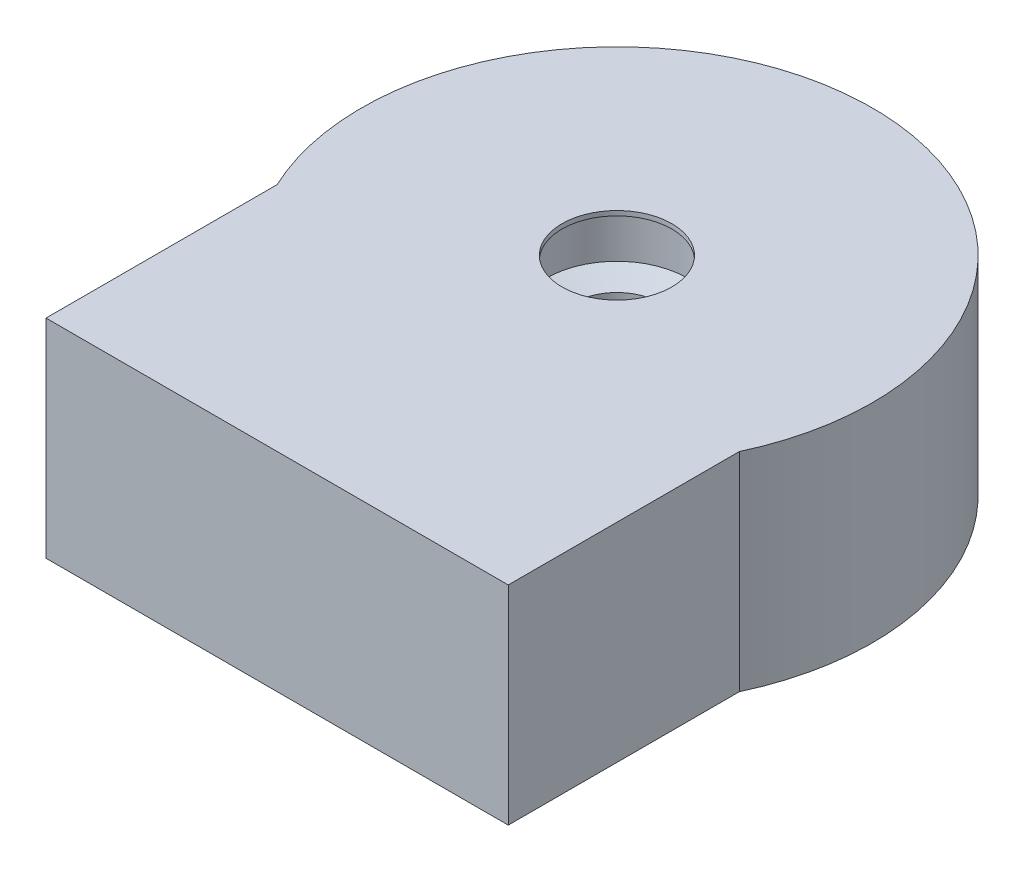
ISO-10303-21;
HEADER;
FILE_DESCRIPTION(('STEP AP214'),'2;1');
FILE_NAME('part.step','',(''),(''),'','','');
FILE_SCHEMA(('AUTOMOTIVE_DESIGN { 1 0 10303 214 1 1 1 1 }'));
ENDSEC;
DATA;
#1=APPLICATION_CONTEXT('core data for automotive mechanical design processes');
#2=APPLICATION_PROTOCOL_DEFINITION('international standard','automotive_design',2000,#1);
#3=PRODUCT_CONTEXT('',#1,'mechanical');
#4=PRODUCT('Part','Part','',(#3));
#5=PRODUCT_RELATED_PRODUCT_CATEGORY('part','',(#4));
#6=PRODUCT_DEFINITION_FORMATION('','',#4);
#7=PRODUCT_DEFINITION_CONTEXT('part definition',#1,'design');
#8=PRODUCT_DEFINITION('design','',#6,#7);
#9=PRODUCT_DEFINITION_SHAPE('','',#8);
#10=(LENGTH_UNIT() NAMED_UNIT(*) SI_UNIT(.MILLI.,.METRE.));
#11=(NAMED_UNIT(*) PLANE_ANGLE_UNIT() SI_UNIT($,.RADIAN.));
#12=(NAMED_UNIT(*) SI_UNIT($,.STERADIAN.) SOLID_ANGLE_UNIT());
#13=UNCERTAINTY_MEASURE_WITH_UNIT(LENGTH_MEASURE(1.E-05),#10,'distance_accuracy_value','');
#14=(GEOMETRIC_REPRESENTATION_CONTEXT(3) GLOBAL_UNCERTAINTY_ASSIGNED_CONTEXT((#13)) GLOBAL_UNIT_ASSIGNED_CONTEXT((#10,
#11,#12)) REPRESENTATION_CONTEXT('',''));
#15=CARTESIAN_POINT('',(0.,0.,0.));
#16=DIRECTION('',(0.,0.,1.));
#17=DIRECTION('',(1.,0.,0.));
#18=AXIS2_PLACEMENT_3D('',#15,#16,#17);
#19=CARTESIAN_POINT('',(0.,0.,0.));
#20=DIRECTION('',(0.,-1.,0.));
#21=DIRECTION('',(0.,0.,-1.));
#22=AXIS2_PLACEMENT_3D('',#19,#20,#21);
#23=CYLINDRICAL_SURFACE('',#22,11.05);
#24=DIRECTION('',(0.,1.,0.));
#25=VECTOR('',#24,1.);
#26=CARTESIAN_POINT('',(10.,-31.3606797749979,4.70132959916661));
#27=LINE('',#26,#25);
#28=CARTESIAN_POINT('',(10.,-9.,4.70132959916661));
#29=VERTEX_POINT('',#28);
#30=CARTESIAN_POINT('',(10.,0.,4.70132959916661));
#31=VERTEX_POINT('',#30);
#32=EDGE_CURVE('E77',#29,#31,#27,.T.);
#33=ORIENTED_EDGE('',*,*,#32,.F.);
#34=CARTESIAN_POINT('',(0.,-9.,0.));
#35=DIRECTION('',(0.,-1.,0.));
#36=DIRECTION('',(0.,0.,-1.));
#37=AXIS2_PLACEMENT_3D('',#34,#35,#36);
#38=CIRCLE('',#37,11.05);
#39=CARTESIAN_POINT('',(-10.,-9.,4.7013295991666));
#40=VERTEX_POINT('',#39);
#41=EDGE_CURVE('E97',#40,#29,#38,.T.);
#42=ORIENTED_EDGE('',*,*,#41,.F.);
#43=DIRECTION('',(0.,1.,0.));
#44=VECTOR('',#43,1.);
#45=CARTESIAN_POINT('',(-10.,-31.3606797749979,4.70132959916661));
#46=LINE('',#45,#44);
#47=CARTESIAN_POINT('',(-10.,0.,4.70132959916661));
#48=VERTEX_POINT('',#47);
#49=EDGE_CURVE('E98',#40,#48,#46,.T.);
#50=ORIENTED_EDGE('',*,*,#49,.T.);
#51=CARTESIAN_POINT('',(0.,0.,0.));
#52=DIRECTION('',(0.,-1.,0.));
#53=DIRECTION('',(0.,0.,-1.));
#54=AXIS2_PLACEMENT_3D('',#51,#52,#53);
#55=CIRCLE('',#54,11.05);
#56=EDGE_CURVE('E11',#48,#31,#55,.T.);
#57=ORIENTED_EDGE('',*,*,#56,.T.);
#58=EDGE_LOOP('',(#33,#42,#50,#57));
#59=FACE_BOUND('',#58,.T.);
#60=ADVANCED_FACE('F39',(#59),#23,.T.);
#61=CARTESIAN_POINT('',(11.05,0.,0.));
#62=DIRECTION('',(0.,1.,0.));
#63=DIRECTION('',(0.,0.,1.));
#64=AXIS2_PLACEMENT_3D('',#61,#62,#63);
#65=PLANE('',#64);
#66=ORIENTED_EDGE('',*,*,#56,.F.);
#67=DIRECTION('',(0.,0.,-1.));
#68=VECTOR('',#67,1.);
#69=CARTESIAN_POINT('',(-10.,0.,14.7013295991666));
#70=LINE('',#69,#68);
#71=CARTESIAN_POINT('',(-10.,0.,14.7013295991666));
#72=VERTEX_POINT('',#71);
#73=EDGE_CURVE('E106',#72,#48,#70,.T.);
#74=ORIENTED_EDGE('',*,*,#73,.F.);
#75=DIRECTION('',(1.,0.,0.));
#76=VECTOR('',#75,1.);
#77=CARTESIAN_POINT('',(-10.,0.,14.7013295991666));
#78=LINE('',#77,#76);
#79=CARTESIAN_POINT('',(10.,0.,14.7013295991666));
#80=VERTEX_POINT('',#79);
#81=EDGE_CURVE('E150',#72,#80,#78,.T.);
#82=ORIENTED_EDGE('',*,*,#81,.T.);
#83=DIRECTION('',(0.,0.,-1.));
#84=VECTOR('',#83,1.);
#85=CARTESIAN_POINT('',(10.,0.,14.7013295991666));
#86=LINE('',#85,#84);
#87=EDGE_CURVE('E92',#80,#31,#86,.T.);
#88=ORIENTED_EDGE('',*,*,#87,.T.);
#89=EDGE_LOOP('',(#66,#74,#82,#88));
#90=FACE_BOUND('',#89,.T.);
#91=CARTESIAN_POINT('',(0.,0.,0.));
#92=DIRECTION('',(0.,-1.,0.));
#93=DIRECTION('',(0.,0.,-1.));
#94=AXIS2_PLACEMENT_3D('',#91,#92,#93);
#95=CIRCLE('',#94,2.375);
#96=CARTESIAN_POINT('',(0.,0.,-2.375));
#97=VERTEX_POINT('',#96);
#98=EDGE_CURVE('E46',#97,#97,#95,.T.);
#99=ORIENTED_EDGE('',*,*,#98,.T.);
#100=EDGE_LOOP('',(#99));
#101=FACE_BOUND('',#100,.T.);
#102=ADVANCED_FACE('F129',(#90,#101),#65,.T.);
#103=CARTESIAN_POINT('',(0.,0.,0.));
#104=DIRECTION('',(0.,-1.,0.));
#105=DIRECTION('',(0.,0.,-1.));
#106=AXIS2_PLACEMENT_3D('',#103,#104,#105);
#107=CYLINDRICAL_SURFACE('',#106,2.375);
#108=CARTESIAN_POINT('',(0.,-0.200000000000001,0.));
#109=DIRECTION('',(0.,-1.,0.));
#110=DIRECTION('',(0.,0.,-1.));
#111=AXIS2_PLACEMENT_3D('',#108,#109,#110);
#112=CIRCLE('',#111,2.375);
#113=CARTESIAN_POINT('',(0.,-0.200000000000001,-2.375));
#114=VERTEX_POINT('',#113);
#115=EDGE_CURVE('E124',#114,#114,#112,.T.);
#116=ORIENTED_EDGE('',*,*,#115,.T.);
#117=EDGE_LOOP('',(#116));
#118=FACE_BOUND('',#117,.T.);
#119=ORIENTED_EDGE('',*,*,#98,.F.);
#120=EDGE_LOOP('',(#119));
#121=FACE_BOUND('',#120,.T.);
#122=ADVANCED_FACE('F131',(#118,#121),#107,.F.);
#123=CARTESIAN_POINT('',(2.375,-0.200000000000001,0.));
#124=DIRECTION('',(0.,-1.,0.));
#125=DIRECTION('',(0.,0.,-1.));
#126=AXIS2_PLACEMENT_3D('',#123,#124,#125);
#127=PLANE('',#126);
#128=CARTESIAN_POINT('',(0.,-0.200000000000001,0.));
#129=DIRECTION('',(0.,-1.,0.));
#130=DIRECTION('',(0.,0.,-1.));
#131=AXIS2_PLACEMENT_3D('',#128,#129,#130);
#132=CIRCLE('',#131,3.05);
#133=CARTESIAN_POINT('',(0.,-0.200000000000001,-3.05));
#134=VERTEX_POINT('',#133);
#135=EDGE_CURVE('E121',#134,#134,#132,.T.);
#136=ORIENTED_EDGE('',*,*,#135,.T.);
#137=EDGE_LOOP('',(#136));
#138=FACE_BOUND('',#137,.T.);
#139=ORIENTED_EDGE('',*,*,#115,.F.);
#140=EDGE_LOOP('',(#139));
#141=FACE_BOUND('',#140,.T.);
#142=ADVANCED_FACE('F133',(#138,#141),#127,.T.);
#143=CARTESIAN_POINT('',(0.,0.,0.));
#144=DIRECTION('',(0.,-1.,0.));
#145=DIRECTION('',(0.,0.,-1.));
#146=AXIS2_PLACEMENT_3D('',#143,#144,#145);
#147=CYLINDRICAL_SURFACE('',#146,3.05);
#148=CARTESIAN_POINT('',(0.,-2.37846096908265,0.));
#149=DIRECTION('',(0.,-1.,0.));
#150=DIRECTION('',(0.,0.,-1.));
#151=AXIS2_PLACEMENT_3D('',#148,#149,#150);
#152=CIRCLE('',#151,3.05);
#153=CARTESIAN_POINT('',(0.,-2.37846096908265,-3.05));
#154=VERTEX_POINT('',#153);
#155=EDGE_CURVE('E118',#154,#154,#152,.T.);
#156=ORIENTED_EDGE('',*,*,#155,.T.);
#157=EDGE_LOOP('',(#156));
#158=FACE_BOUND('',#157,.T.);
#159=ORIENTED_EDGE('',*,*,#135,.F.);
#160=EDGE_LOOP('',(#159));
#161=FACE_BOUND('',#160,.T.);
#162=ADVANCED_FACE('F139',(#158,#161),#147,.F.);
#163=CARTESIAN_POINT('',(0.,-2.7,0.));
#164=DIRECTION('',(0.,1.,0.));
#165=DIRECTION('',(0.,0.,1.));
#166=AXIS2_PLACEMENT_3D('',#163,#164,#165);
#167=CONICAL_SURFACE('',#166,1.85,1.30899693899574);
#168=ORIENTED_EDGE('',*,*,#155,.F.);
#169=EDGE_LOOP('',(#168));
#170=FACE_BOUND('',#169,.T.);
#171=CARTESIAN_POINT('',(0.,-2.7,0.));
#172=DIRECTION('',(0.,-1.,0.));
#173=DIRECTION('',(0.,0.,-1.));
#174=AXIS2_PLACEMENT_3D('',#171,#172,#173);
#175=CIRCLE('',#174,1.85);
#176=CARTESIAN_POINT('',(0.,-2.7,-1.85));
#177=VERTEX_POINT('',#176);
#178=EDGE_CURVE('E115',#177,#177,#175,.T.);
#179=ORIENTED_EDGE('',*,*,#178,.T.);
#180=EDGE_LOOP('',(#179));
#181=FACE_BOUND('',#180,.T.);
#182=ADVANCED_FACE('F175',(#170,#181),#167,.F.);
#183=CARTESIAN_POINT('',(0.,0.,0.));
#184=DIRECTION('',(0.,-1.,0.));
#185=DIRECTION('',(0.,0.,-1.));
#186=AXIS2_PLACEMENT_3D('',#183,#184,#185);
#187=CYLINDRICAL_SURFACE('',#186,1.85);
#188=CARTESIAN_POINT('',(0.,-6.3,0.));
#189=DIRECTION('',(0.,-1.,0.));
#190=DIRECTION('',(0.,0.,-1.));
#191=AXIS2_PLACEMENT_3D('',#188,#189,#190);
#192=CIRCLE('',#191,1.85);
#193=CARTESIAN_POINT('',(0.,-6.3,-1.85));
#194=VERTEX_POINT('',#193);
#195=EDGE_CURVE('E112',#194,#194,#192,.T.);
#196=ORIENTED_EDGE('',*,*,#195,.T.);
#197=EDGE_LOOP('',(#196));
#198=FACE_BOUND('',#197,.T.);
#199=ORIENTED_EDGE('',*,*,#178,.F.);
#200=EDGE_LOOP('',(#199));
#201=FACE_BOUND('',#200,.T.);
#202=ADVANCED_FACE('F171',(#198,#201),#187,.F.);
#203=CARTESIAN_POINT('',(0.,-6.3,0.));
#204=DIRECTION('',(0.,1.,0.));
#205=DIRECTION('',(0.,0.,1.));
#206=AXIS2_PLACEMENT_3D('',#203,#204,#205);
#207=CONICAL_SURFACE('',#206,1.85,0.785398163397449);
#208=CARTESIAN_POINT('',(0.,-7.,0.));
#209=DIRECTION('',(0.,-1.,0.));
#210=DIRECTION('',(0.,0.,-1.));
#211=AXIS2_PLACEMENT_3D('',#208,#209,#210);
#212=CIRCLE('',#211,1.15);
#213=CARTESIAN_POINT('',(0.,-7.,-1.15));
#214=VERTEX_POINT('',#213);
#215=EDGE_CURVE('E109',#214,#214,#212,.T.);
#216=ORIENTED_EDGE('',*,*,#215,.T.);
#217=EDGE_LOOP('',(#216));
#218=FACE_BOUND('',#217,.T.);
#219=ORIENTED_EDGE('',*,*,#195,.F.);
#220=EDGE_LOOP('',(#219));
#221=FACE_BOUND('',#220,.T.);
#222=ADVANCED_FACE('F167',(#218,#221),#207,.F.);
#223=CARTESIAN_POINT('',(1.15,-7.,0.));
#224=DIRECTION('',(0.,1.,0.));
#225=DIRECTION('',(0.,0.,1.));
#226=AXIS2_PLACEMENT_3D('',#223,#224,#225);
#227=PLANE('',#226);
#228=ORIENTED_EDGE('',*,*,#215,.F.);
#229=EDGE_LOOP('',(#228));
#230=FACE_BOUND('',#229,.T.);
#231=ADVANCED_FACE('F165',(#230),#227,.T.);
#232=CARTESIAN_POINT('',(0.,-9.,0.));
#233=DIRECTION('',(0.,-1.,0.));
#234=DIRECTION('',(0.,0.,-1.));
#235=AXIS2_PLACEMENT_3D('',#232,#233,#234);
#236=PLANE('',#235);
#237=ORIENTED_EDGE('',*,*,#41,.T.);
#238=DIRECTION('',(0.,0.,-1.));
#239=VECTOR('',#238,1.);
#240=CARTESIAN_POINT('',(10.,-9.,14.7013295991666));
#241=LINE('',#240,#239);
#242=CARTESIAN_POINT('',(10.,-9.,14.7013295991666));
#243=VERTEX_POINT('',#242);
#244=EDGE_CURVE('E83',#243,#29,#241,.T.);
#245=ORIENTED_EDGE('',*,*,#244,.F.);
#246=DIRECTION('',(1.,0.,0.));
#247=VECTOR('',#246,1.);
#248=CARTESIAN_POINT('',(-10.,-9.,14.7013295991666));
#249=LINE('',#248,#247);
#250=CARTESIAN_POINT('',(-10.,-9.,14.7013295991666));
#251=VERTEX_POINT('',#250);
#252=EDGE_CURVE('E86',#251,#243,#249,.T.);
#253=ORIENTED_EDGE('',*,*,#252,.F.);
#254=DIRECTION('',(0.,0.,-1.));
#255=VECTOR('',#254,1.);
#256=CARTESIAN_POINT('',(-10.,-9.,14.7013295991666));
#257=LINE('',#256,#255);
#258=EDGE_CURVE('E53',#251,#40,#257,.T.);
#259=ORIENTED_EDGE('',*,*,#258,.T.);
#260=EDGE_LOOP('',(#237,#245,#253,#259));
#261=FACE_BOUND('',#260,.T.);
#262=ADVANCED_FACE('F95',(#261),#236,.T.);
#263=CARTESIAN_POINT('',(10.,-31.3606797749979,14.7013295991666));
#264=DIRECTION('',(1.,0.,0.));
#265=DIRECTION('',(0.,0.,-1.));
#266=AXIS2_PLACEMENT_3D('',#263,#264,#265);
#267=PLANE('',#266);
#268=DIRECTION('',(0.,1.,0.));
#269=VECTOR('',#268,1.);
#270=CARTESIAN_POINT('',(10.,-31.3606797749979,14.7013295991666));
#271=LINE('',#270,#269);
#272=EDGE_CURVE('E89',#243,#80,#271,.T.);
#273=ORIENTED_EDGE('',*,*,#272,.F.);
#274=ORIENTED_EDGE('',*,*,#244,.T.);
#275=ORIENTED_EDGE('',*,*,#32,.T.);
#276=ORIENTED_EDGE('',*,*,#87,.F.);
#277=EDGE_LOOP('',(#273,#274,#275,#276));
#278=FACE_BOUND('',#277,.T.);
#279=ADVANCED_FACE('F91',(#278),#267,.T.);
#280=CARTESIAN_POINT('',(-10.,-31.3606797749979,14.7013295991666));
#281=DIRECTION('',(0.,0.,1.));
#282=DIRECTION('',(1.,0.,0.));
#283=AXIS2_PLACEMENT_3D('',#280,#281,#282);
#284=PLANE('',#283);
#285=DIRECTION('',(0.,1.,0.));
#286=VECTOR('',#285,1.);
#287=CARTESIAN_POINT('',(-10.,-31.3606797749979,14.7013295991666));
#288=LINE('',#287,#286);
#289=EDGE_CURVE('E61',#251,#72,#288,.T.);
#290=ORIENTED_EDGE('',*,*,#289,.F.);
#291=ORIENTED_EDGE('',*,*,#252,.T.);
#292=ORIENTED_EDGE('',*,*,#272,.T.);
#293=ORIENTED_EDGE('',*,*,#81,.F.);
#294=EDGE_LOOP('',(#290,#291,#292,#293));
#295=FACE_BOUND('',#294,.T.);
#296=ADVANCED_FACE('F87',(#295),#284,.T.);
#297=CARTESIAN_POINT('',(-10.,-31.3606797749979,14.7013295991666));
#298=DIRECTION('',(1.,0.,0.));
#299=DIRECTION('',(0.,0.,-1.));
#300=AXIS2_PLACEMENT_3D('',#297,#298,#299);
#301=PLANE('',#300);
#302=ORIENTED_EDGE('',*,*,#258,.F.);
#303=ORIENTED_EDGE('',*,*,#289,.T.);
#304=ORIENTED_EDGE('',*,*,#73,.T.);
#305=ORIENTED_EDGE('',*,*,#49,.F.);
#306=EDGE_LOOP('',(#302,#303,#304,#305));
#307=FACE_BOUND('',#306,.T.);
#308=ADVANCED_FACE('F153',(#307),#301,.F.);
#309=CLOSED_SHELL('',(#60,#102,#122,#142,#162,#182,#202,#222,#231,#262,#279,#296,#308));
#310=MANIFOLD_SOLID_BREP('B2',#309);
#311=ADVANCED_BREP_SHAPE_REPRESENTATION('',(#18,#310),#14);
#312=SHAPE_DEFINITION_REPRESENTATION(#9,#311);
ENDSEC;
END-ISO-10303-21;
